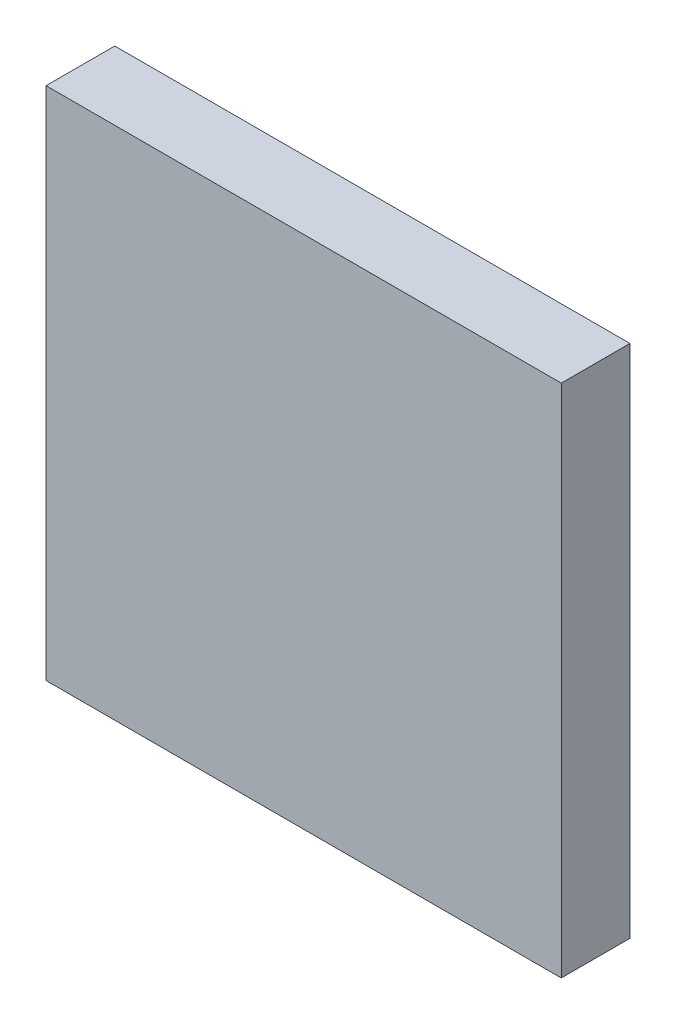
ISO-10303-21;
HEADER;
FILE_DESCRIPTION(('STEP AP214'),'2;1');
FILE_NAME('part.step','',(''),(''),'','','');
FILE_SCHEMA(('AUTOMOTIVE_DESIGN { 1 0 10303 214 1 1 1 1 }'));
ENDSEC;
DATA;
#1=APPLICATION_CONTEXT('core data for automotive mechanical design processes');
#2=APPLICATION_PROTOCOL_DEFINITION('international standard','automotive_design',2000,#1);
#3=PRODUCT_CONTEXT('',#1,'mechanical');
#4=PRODUCT('Part','Part','',(#3));
#5=PRODUCT_RELATED_PRODUCT_CATEGORY('part','',(#4));
#6=PRODUCT_DEFINITION_FORMATION('','',#4);
#7=PRODUCT_DEFINITION_CONTEXT('part definition',#1,'design');
#8=PRODUCT_DEFINITION('design','',#6,#7);
#9=PRODUCT_DEFINITION_SHAPE('','',#8);
#10=(LENGTH_UNIT() NAMED_UNIT(*) SI_UNIT(.MILLI.,.METRE.));
#11=(NAMED_UNIT(*) PLANE_ANGLE_UNIT() SI_UNIT($,.RADIAN.));
#12=(NAMED_UNIT(*) SI_UNIT($,.STERADIAN.) SOLID_ANGLE_UNIT());
#13=UNCERTAINTY_MEASURE_WITH_UNIT(LENGTH_MEASURE(1.E-05),#10,'distance_accuracy_value','');
#14=(GEOMETRIC_REPRESENTATION_CONTEXT(3) GLOBAL_UNCERTAINTY_ASSIGNED_CONTEXT((#13)) GLOBAL_UNIT_ASSIGNED_CONTEXT((#10,
#11,#12)) REPRESENTATION_CONTEXT('',''));
#15=CARTESIAN_POINT('',(0.,0.,0.));
#16=DIRECTION('',(0.,0.,1.));
#17=DIRECTION('',(1.,0.,0.));
#18=AXIS2_PLACEMENT_3D('',#15,#16,#17);
#19=CARTESIAN_POINT('',(0.,0.75000104,0.1999996));
#20=DIRECTION('',(0.,0.,-1.));
#21=DIRECTION('',(-1.,0.,0.));
#22=AXIS2_PLACEMENT_3D('',#19,#20,#21);
#23=PLANE('',#22);
#24=DIRECTION('',(0.,-1.,0.));
#25=VECTOR('',#24,1.);
#26=CARTESIAN_POINT('',(1.49999954,0.75000104,0.1999996));
#27=LINE('',#26,#25);
#28=CARTESIAN_POINT('',(1.49999954,2.25000058,0.1999996));
#29=VERTEX_POINT('',#28);
#30=CARTESIAN_POINT('',(1.49999954,0.75000104,0.1999996));
#31=VERTEX_POINT('',#30);
#32=EDGE_CURVE('E11',#29,#31,#27,.T.);
#33=ORIENTED_EDGE('',*,*,#32,.F.);
#34=DIRECTION('',(1.,0.,0.));
#35=VECTOR('',#34,1.);
#36=CARTESIAN_POINT('',(0.,2.25000058,0.1999996));
#37=LINE('',#36,#35);
#38=CARTESIAN_POINT('',(0.,2.25000058,0.1999996));
#39=VERTEX_POINT('',#38);
#40=EDGE_CURVE('E24',#39,#29,#37,.T.);
#41=ORIENTED_EDGE('',*,*,#40,.F.);
#42=DIRECTION('',(0.,1.,0.));
#43=VECTOR('',#42,1.);
#44=CARTESIAN_POINT('',(0.,0.75000104,0.1999996));
#45=LINE('',#44,#43);
#46=CARTESIAN_POINT('',(0.,0.75000104,0.1999996));
#47=VERTEX_POINT('',#46);
#48=EDGE_CURVE('E60',#47,#39,#45,.T.);
#49=ORIENTED_EDGE('',*,*,#48,.F.);
#50=DIRECTION('',(-1.,0.,0.));
#51=VECTOR('',#50,1.);
#52=CARTESIAN_POINT('',(0.,0.75000104,0.1999996));
#53=LINE('',#52,#51);
#54=EDGE_CURVE('E85',#31,#47,#53,.T.);
#55=ORIENTED_EDGE('',*,*,#54,.F.);
#56=EDGE_LOOP('',(#33,#41,#49,#55));
#57=FACE_BOUND('',#56,.T.);
#58=ADVANCED_FACE('F17',(#57),#23,.F.);
#59=CARTESIAN_POINT('',(0.,0.75000104,0.));
#60=DIRECTION('',(0.,1.,0.));
#61=DIRECTION('',(0.,0.,1.));
#62=AXIS2_PLACEMENT_3D('',#59,#60,#61);
#63=PLANE('',#62);
#64=DIRECTION('',(0.,0.,-1.));
#65=VECTOR('',#64,1.);
#66=CARTESIAN_POINT('',(1.49999954,0.75000104,0.));
#67=LINE('',#66,#65);
#68=CARTESIAN_POINT('',(1.49999954,0.75000104,0.));
#69=VERTEX_POINT('',#68);
#70=EDGE_CURVE('E83',#31,#69,#67,.T.);
#71=ORIENTED_EDGE('',*,*,#70,.F.);
#72=ORIENTED_EDGE('',*,*,#54,.T.);
#73=DIRECTION('',(0.,0.,1.));
#74=VECTOR('',#73,1.);
#75=CARTESIAN_POINT('',(0.,0.75000104,0.));
#76=LINE('',#75,#74);
#77=CARTESIAN_POINT('',(0.,0.75000104,0.));
#78=VERTEX_POINT('',#77);
#79=EDGE_CURVE('E81',#78,#47,#76,.T.);
#80=ORIENTED_EDGE('',*,*,#79,.F.);
#81=DIRECTION('',(-1.,0.,0.));
#82=VECTOR('',#81,1.);
#83=CARTESIAN_POINT('',(0.,0.75000104,0.));
#84=LINE('',#83,#82);
#85=EDGE_CURVE('E75',#69,#78,#84,.T.);
#86=ORIENTED_EDGE('',*,*,#85,.F.);
#87=EDGE_LOOP('',(#71,#72,#80,#86));
#88=FACE_BOUND('',#87,.T.);
#89=ADVANCED_FACE('F91',(#88),#63,.F.);
#90=CARTESIAN_POINT('',(1.49999954,0.75000104,0.));
#91=DIRECTION('',(-1.,0.,0.));
#92=DIRECTION('',(0.,0.,1.));
#93=AXIS2_PLACEMENT_3D('',#90,#91,#92);
#94=PLANE('',#93);
#95=DIRECTION('',(0.,0.,-1.));
#96=VECTOR('',#95,1.);
#97=CARTESIAN_POINT('',(1.49999954,2.25000058,0.));
#98=LINE('',#97,#96);
#99=CARTESIAN_POINT('',(1.49999954,2.25000058,0.));
#100=VERTEX_POINT('',#99);
#101=EDGE_CURVE('E67',#29,#100,#98,.T.);
#102=ORIENTED_EDGE('',*,*,#101,.F.);
#103=ORIENTED_EDGE('',*,*,#32,.T.);
#104=ORIENTED_EDGE('',*,*,#70,.T.);
#105=DIRECTION('',(0.,-1.,0.));
#106=VECTOR('',#105,1.);
#107=CARTESIAN_POINT('',(1.49999954,0.75000104,0.));
#108=LINE('',#107,#106);
#109=EDGE_CURVE('E62',#100,#69,#108,.T.);
#110=ORIENTED_EDGE('',*,*,#109,.F.);
#111=EDGE_LOOP('',(#102,#103,#104,#110));
#112=FACE_BOUND('',#111,.T.);
#113=ADVANCED_FACE('F88',(#112),#94,.F.);
#114=CARTESIAN_POINT('',(1.49999954,2.25000058,0.));
#115=DIRECTION('',(0.,-1.,0.));
#116=DIRECTION('',(0.,0.,-1.));
#117=AXIS2_PLACEMENT_3D('',#114,#115,#116);
#118=PLANE('',#117);
#119=DIRECTION('',(0.,0.,-1.));
#120=VECTOR('',#119,1.);
#121=CARTESIAN_POINT('',(0.,2.25000058,0.));
#122=LINE('',#121,#120);
#123=CARTESIAN_POINT('',(0.,2.25000058,0.));
#124=VERTEX_POINT('',#123);
#125=EDGE_CURVE('E54',#39,#124,#122,.T.);
#126=ORIENTED_EDGE('',*,*,#125,.F.);
#127=ORIENTED_EDGE('',*,*,#40,.T.);
#128=ORIENTED_EDGE('',*,*,#101,.T.);
#129=DIRECTION('',(1.,0.,0.));
#130=VECTOR('',#129,1.);
#131=CARTESIAN_POINT('',(1.49999954,2.25000058,0.));
#132=LINE('',#131,#130);
#133=EDGE_CURVE('E63',#124,#100,#132,.T.);
#134=ORIENTED_EDGE('',*,*,#133,.F.);
#135=EDGE_LOOP('',(#126,#127,#128,#134));
#136=FACE_BOUND('',#135,.T.);
#137=ADVANCED_FACE('F66',(#136),#118,.F.);
#138=CARTESIAN_POINT('',(0.,2.25000058,0.));
#139=DIRECTION('',(1.,0.,0.));
#140=DIRECTION('',(0.,0.,-1.));
#141=AXIS2_PLACEMENT_3D('',#138,#139,#140);
#142=PLANE('',#141);
#143=ORIENTED_EDGE('',*,*,#79,.T.);
#144=ORIENTED_EDGE('',*,*,#48,.T.);
#145=ORIENTED_EDGE('',*,*,#125,.T.);
#146=DIRECTION('',(0.,1.,0.));
#147=VECTOR('',#146,1.);
#148=CARTESIAN_POINT('',(0.,2.25000058,0.));
#149=LINE('',#148,#147);
#150=EDGE_CURVE('E59',#78,#124,#149,.T.);
#151=ORIENTED_EDGE('',*,*,#150,.F.);
#152=EDGE_LOOP('',(#143,#144,#145,#151));
#153=FACE_BOUND('',#152,.T.);
#154=ADVANCED_FACE('F57',(#153),#142,.F.);
#155=CARTESIAN_POINT('',(0.,0.75000104,0.));
#156=DIRECTION('',(0.,0.,-1.));
#157=DIRECTION('',(-1.,0.,0.));
#158=AXIS2_PLACEMENT_3D('',#155,#156,#157);
#159=PLANE('',#158);
#160=ORIENTED_EDGE('',*,*,#109,.T.);
#161=ORIENTED_EDGE('',*,*,#85,.T.);
#162=ORIENTED_EDGE('',*,*,#150,.T.);
#163=ORIENTED_EDGE('',*,*,#133,.T.);
#164=EDGE_LOOP('',(#160,#161,#162,#163));
#165=FACE_BOUND('',#164,.T.);
#166=ADVANCED_FACE('F73',(#165),#159,.T.);
#167=CLOSED_SHELL('',(#58,#89,#113,#137,#154,#166));
#168=MANIFOLD_SOLID_BREP('B1',#167);
#169=ADVANCED_BREP_SHAPE_REPRESENTATION('',(#18,#168),#14);
#170=SHAPE_DEFINITION_REPRESENTATION(#9,#169);
ENDSEC;
END-ISO-10303-21;
